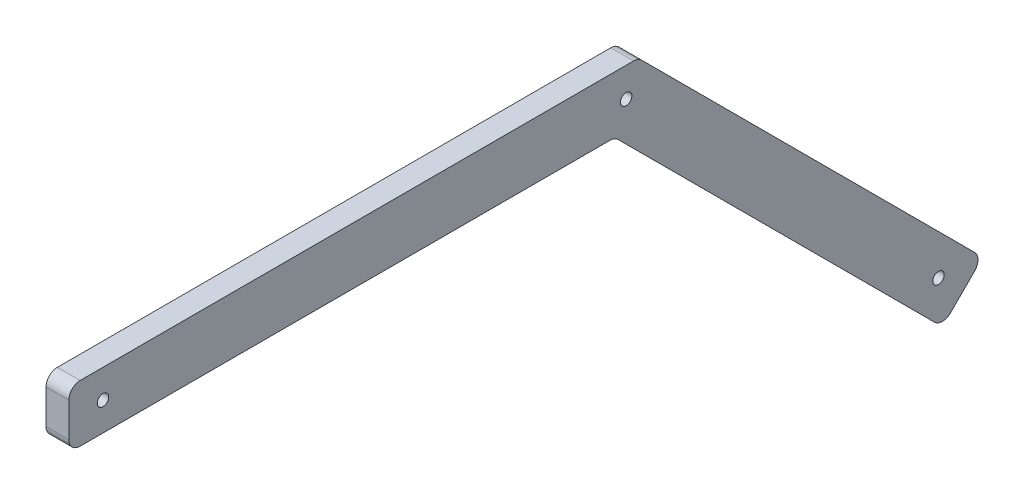
ISO-10303-21;
HEADER;
FILE_DESCRIPTION(('STEP AP214'),'2;1');
FILE_NAME('part.step','',(''),(''),'','','');
FILE_SCHEMA(('AUTOMOTIVE_DESIGN { 1 0 10303 214 1 1 1 1 }'));
ENDSEC;
DATA;
#1=APPLICATION_CONTEXT('core data for automotive mechanical design processes');
#2=APPLICATION_PROTOCOL_DEFINITION('international standard','automotive_design',2000,#1);
#3=PRODUCT_CONTEXT('',#1,'mechanical');
#4=PRODUCT('Part','Part','',(#3));
#5=PRODUCT_RELATED_PRODUCT_CATEGORY('part','',(#4));
#6=PRODUCT_DEFINITION_FORMATION('','',#4);
#7=PRODUCT_DEFINITION_CONTEXT('part definition',#1,'design');
#8=PRODUCT_DEFINITION('design','',#6,#7);
#9=PRODUCT_DEFINITION_SHAPE('','',#8);
#10=(LENGTH_UNIT() NAMED_UNIT(*) SI_UNIT(.MILLI.,.METRE.));
#11=(NAMED_UNIT(*) PLANE_ANGLE_UNIT() SI_UNIT($,.RADIAN.));
#12=(NAMED_UNIT(*) SI_UNIT($,.STERADIAN.) SOLID_ANGLE_UNIT());
#13=UNCERTAINTY_MEASURE_WITH_UNIT(LENGTH_MEASURE(1.E-05),#10,'distance_accuracy_value','');
#14=(GEOMETRIC_REPRESENTATION_CONTEXT(3) GLOBAL_UNCERTAINTY_ASSIGNED_CONTEXT((#13)) GLOBAL_UNIT_ASSIGNED_CONTEXT((#10,
#11,#12)) REPRESENTATION_CONTEXT('',''));
#15=CARTESIAN_POINT('',(0.,0.,0.));
#16=DIRECTION('',(0.,0.,1.));
#17=DIRECTION('',(1.,0.,0.));
#18=AXIS2_PLACEMENT_3D('',#15,#16,#17);
#19=CARTESIAN_POINT('',(20.,0.,0.));
#20=DIRECTION('',(0.,1.,0.));
#21=DIRECTION('',(0.,0.,1.));
#22=AXIS2_PLACEMENT_3D('',#19,#20,#21);
#23=PLANE('',#22);
#24=DIRECTION('',(0.,0.,-1.));
#25=VECTOR('',#24,1.);
#26=CARTESIAN_POINT('',(0.,0.,0.));
#27=LINE('',#26,#25);
#28=CARTESIAN_POINT('',(0.,0.,-10.));
#29=VERTEX_POINT('',#28);
#30=CARTESIAN_POINT('',(0.,0.,-475.147186257614));
#31=VERTEX_POINT('',#30);
#32=EDGE_CURVE('E159',#29,#31,#27,.T.);
#33=ORIENTED_EDGE('',*,*,#32,.T.);
#34=DIRECTION('',(-1.,0.,0.));
#35=VECTOR('',#34,1.);
#36=CARTESIAN_POINT('',(20.,0.,-475.147186257614));
#37=LINE('',#36,#35);
#38=CARTESIAN_POINT('',(20.,0.,-475.147186257614));
#39=VERTEX_POINT('',#38);
#40=EDGE_CURVE('E135',#31,#39,#37,.F.);
#41=ORIENTED_EDGE('',*,*,#40,.T.);
#42=DIRECTION('',(0.,0.,-1.));
#43=VECTOR('',#42,1.);
#44=CARTESIAN_POINT('',(20.,0.,0.));
#45=LINE('',#44,#43);
#46=CARTESIAN_POINT('',(20.,0.,-10.));
#47=VERTEX_POINT('',#46);
#48=EDGE_CURVE('E179',#47,#39,#45,.T.);
#49=ORIENTED_EDGE('',*,*,#48,.F.);
#50=DIRECTION('',(-1.,0.,0.));
#51=VECTOR('',#50,1.);
#52=CARTESIAN_POINT('',(0.,0.,-10.));
#53=LINE('',#52,#51);
#54=EDGE_CURVE('E150',#47,#29,#53,.T.);
#55=ORIENTED_EDGE('',*,*,#54,.T.);
#56=EDGE_LOOP('',(#33,#41,#49,#55));
#57=FACE_BOUND('',#56,.T.);
#58=ADVANCED_FACE('F40',(#57),#23,.F.);
#59=CARTESIAN_POINT('',(20.,239.644660940673,-239.644660940673));
#60=DIRECTION('',(0.,0.707106781186546,-0.707106781186549));
#61=DIRECTION('',(0.,0.707106781186549,0.707106781186546));
#62=AXIS2_PLACEMENT_3D('',#59,#60,#61);
#63=PLANE('',#62);
#64=DIRECTION('',(0.,-0.707106781186549,-0.707106781186546));
#65=VECTOR('',#64,1.);
#66=CARTESIAN_POINT('',(20.,239.644660940673,-239.644660940673));
#67=LINE('',#66,#65);
#68=CARTESIAN_POINT('',(20.,-2.92893218813448,-482.218254069479));
#69=VERTEX_POINT('',#68);
#70=CARTESIAN_POINT('',(20.,-280.651944618272,-759.941266499616));
#71=VERTEX_POINT('',#70);
#72=EDGE_CURVE('E148',#69,#71,#67,.T.);
#73=ORIENTED_EDGE('',*,*,#72,.F.);
#74=DIRECTION('',(-1.,0.,0.));
#75=VECTOR('',#74,1.);
#76=CARTESIAN_POINT('',(0.,-2.92893218813445,-482.218254069479));
#77=LINE('',#76,#75);
#78=CARTESIAN_POINT('',(0.,-2.92893218813448,-482.218254069479));
#79=VERTEX_POINT('',#78);
#80=EDGE_CURVE('E134',#69,#79,#77,.T.);
#81=ORIENTED_EDGE('',*,*,#80,.T.);
#82=DIRECTION('',(0.,-0.707106781186549,-0.707106781186546));
#83=VECTOR('',#82,1.);
#84=CARTESIAN_POINT('',(0.,239.644660940673,-239.644660940673));
#85=LINE('',#84,#83);
#86=CARTESIAN_POINT('',(0.,-280.651944618272,-759.941266499616));
#87=VERTEX_POINT('',#86);
#88=EDGE_CURVE('E145',#79,#87,#85,.T.);
#89=ORIENTED_EDGE('',*,*,#88,.T.);
#90=DIRECTION('',(-1.,0.,0.));
#91=VECTOR('',#90,1.);
#92=CARTESIAN_POINT('',(20.,-280.651944618272,-759.941266499616));
#93=LINE('',#92,#91);
#94=EDGE_CURVE('E151',#87,#71,#93,.F.);
#95=ORIENTED_EDGE('',*,*,#94,.T.);
#96=EDGE_LOOP('',(#73,#81,#89,#95));
#97=FACE_BOUND('',#96,.T.);
#98=ADVANCED_FACE('F144',(#97),#63,.F.);
#99=CARTESIAN_POINT('',(20.,-527.367673370811,-527.367673370805));
#100=DIRECTION('',(0.,-0.707106781186551,-0.707106781186544));
#101=DIRECTION('',(0.,0.707106781186544,-0.707106781186551));
#102=AXIS2_PLACEMENT_3D('',#99,#100,#101);
#103=PLANE('',#102);
#104=DIRECTION('',(0.,-0.707106781186544,0.707106781186551));
#105=VECTOR('',#104,1.);
#106=CARTESIAN_POINT('',(20.,-527.367673370811,-527.367673370805));
#107=LINE('',#106,#105);
#108=CARTESIAN_POINT('',(20.,-259.438741182676,-795.296605558944));
#109=VERTEX_POINT('',#108);
#110=CARTESIAN_POINT('',(20.,-280.651944618272,-774.083402123347));
#111=VERTEX_POINT('',#110);
#112=EDGE_CURVE('E251',#109,#111,#107,.T.);
#113=ORIENTED_EDGE('',*,*,#112,.T.);
#114=DIRECTION('',(-1.,0.,0.));
#115=VECTOR('',#114,1.);
#116=CARTESIAN_POINT('',(0.,-280.651944618272,-774.083402123347));
#117=LINE('',#116,#115);
#118=CARTESIAN_POINT('',(0.,-280.651944618272,-774.083402123347));
#119=VERTEX_POINT('',#118);
#120=EDGE_CURVE('E233',#111,#119,#117,.T.);
#121=ORIENTED_EDGE('',*,*,#120,.T.);
#122=DIRECTION('',(0.,-0.707106781186544,0.707106781186551));
#123=VECTOR('',#122,1.);
#124=CARTESIAN_POINT('',(0.,-527.367673370811,-527.367673370805));
#125=LINE('',#124,#123);
#126=CARTESIAN_POINT('',(0.,-259.438741182676,-795.296605558944));
#127=VERTEX_POINT('',#126);
#128=EDGE_CURVE('E158',#127,#119,#125,.T.);
#129=ORIENTED_EDGE('',*,*,#128,.F.);
#130=DIRECTION('',(-1.,0.,0.));
#131=VECTOR('',#130,1.);
#132=CARTESIAN_POINT('',(20.,-259.438741182676,-795.296605558944));
#133=LINE('',#132,#131);
#134=EDGE_CURVE('E230',#127,#109,#133,.F.);
#135=ORIENTED_EDGE('',*,*,#134,.T.);
#136=EDGE_LOOP('',(#113,#121,#129,#135));
#137=FACE_BOUND('',#136,.T.);
#138=ADVANCED_FACE('F330',(#137),#103,.T.);
#139=CARTESIAN_POINT('',(20.,275.,-275.000000000001));
#140=DIRECTION('',(0.,0.707106781186546,-0.707106781186549));
#141=DIRECTION('',(0.,0.707106781186549,0.707106781186546));
#142=AXIS2_PLACEMENT_3D('',#139,#140,#141);
#143=PLANE('',#142);
#144=DIRECTION('',(0.,-0.707106781186549,-0.707106781186546));
#145=VECTOR('',#144,1.);
#146=CARTESIAN_POINT('',(0.,275.,-275.000000000001));
#147=LINE('',#146,#145);
#148=CARTESIAN_POINT('',(0.,47.0710678118654,-502.928932188135));
#149=VERTEX_POINT('',#148);
#150=CARTESIAN_POINT('',(0.,-245.296605558945,-795.296605558944));
#151=VERTEX_POINT('',#150);
#152=EDGE_CURVE('E163',#149,#151,#147,.T.);
#153=ORIENTED_EDGE('',*,*,#152,.F.);
#154=DIRECTION('',(-1.,0.,0.));
#155=VECTOR('',#154,1.);
#156=CARTESIAN_POINT('',(20.,47.0710678118655,-502.928932188135));
#157=LINE('',#156,#155);
#158=CARTESIAN_POINT('',(20.,47.0710678118654,-502.928932188135));
#159=VERTEX_POINT('',#158);
#160=EDGE_CURVE('E213',#149,#159,#157,.F.);
#161=ORIENTED_EDGE('',*,*,#160,.T.);
#162=DIRECTION('',(0.,-0.707106781186549,-0.707106781186546));
#163=VECTOR('',#162,1.);
#164=CARTESIAN_POINT('',(20.,275.,-275.000000000001));
#165=LINE('',#164,#163);
#166=CARTESIAN_POINT('',(20.,-245.296605558945,-795.296605558944));
#167=VERTEX_POINT('',#166);
#168=EDGE_CURVE('E247',#159,#167,#165,.T.);
#169=ORIENTED_EDGE('',*,*,#168,.T.);
#170=DIRECTION('',(-1.,0.,0.));
#171=VECTOR('',#170,1.);
#172=CARTESIAN_POINT('',(20.,-245.296605558945,-795.296605558944));
#173=LINE('',#172,#171);
#174=EDGE_CURVE('E209',#167,#151,#173,.T.);
#175=ORIENTED_EDGE('',*,*,#174,.T.);
#176=EDGE_LOOP('',(#153,#161,#169,#175));
#177=FACE_BOUND('',#176,.T.);
#178=ADVANCED_FACE('F369',(#177),#143,.T.);
#179=CARTESIAN_POINT('',(20.,50.,0.));
#180=DIRECTION('',(0.,1.,0.));
#181=DIRECTION('',(0.,0.,1.));
#182=AXIS2_PLACEMENT_3D('',#179,#180,#181);
#183=PLANE('',#182);
#184=DIRECTION('',(0.,0.,-1.));
#185=VECTOR('',#184,1.);
#186=CARTESIAN_POINT('',(20.,50.,0.));
#187=LINE('',#186,#185);
#188=CARTESIAN_POINT('',(20.,50.,-10.));
#189=VERTEX_POINT('',#188);
#190=CARTESIAN_POINT('',(20.,50.,-495.857864376269));
#191=VERTEX_POINT('',#190);
#192=EDGE_CURVE('E244',#189,#191,#187,.T.);
#193=ORIENTED_EDGE('',*,*,#192,.T.);
#194=DIRECTION('',(-1.,0.,0.));
#195=VECTOR('',#194,1.);
#196=CARTESIAN_POINT('',(20.,50.,-495.857864376269));
#197=LINE('',#196,#195);
#198=CARTESIAN_POINT('',(0.,50.,-495.857864376269));
#199=VERTEX_POINT('',#198);
#200=EDGE_CURVE('E191',#191,#199,#197,.T.);
#201=ORIENTED_EDGE('',*,*,#200,.T.);
#202=DIRECTION('',(0.,0.,-1.));
#203=VECTOR('',#202,1.);
#204=CARTESIAN_POINT('',(0.,50.,0.));
#205=LINE('',#204,#203);
#206=CARTESIAN_POINT('',(0.,50.,-10.));
#207=VERTEX_POINT('',#206);
#208=EDGE_CURVE('E172',#207,#199,#205,.T.);
#209=ORIENTED_EDGE('',*,*,#208,.F.);
#210=DIRECTION('',(-1.,0.,0.));
#211=VECTOR('',#210,1.);
#212=CARTESIAN_POINT('',(20.,50.,-10.));
#213=LINE('',#212,#211);
#214=EDGE_CURVE('E188',#207,#189,#213,.F.);
#215=ORIENTED_EDGE('',*,*,#214,.T.);
#216=EDGE_LOOP('',(#193,#201,#209,#215));
#217=FACE_BOUND('',#216,.T.);
#218=ADVANCED_FACE('F315',(#217),#183,.T.);
#219=CARTESIAN_POINT('',(20.,0.,0.));
#220=DIRECTION('',(0.,0.,1.));
#221=DIRECTION('',(1.,0.,0.));
#222=AXIS2_PLACEMENT_3D('',#219,#220,#221);
#223=PLANE('',#222);
#224=DIRECTION('',(0.,1.,0.));
#225=VECTOR('',#224,1.);
#226=CARTESIAN_POINT('',(0.,0.,0.));
#227=LINE('',#226,#225);
#228=CARTESIAN_POINT('',(0.,10.,0.));
#229=VERTEX_POINT('',#228);
#230=CARTESIAN_POINT('',(0.,40.,0.));
#231=VERTEX_POINT('',#230);
#232=EDGE_CURVE('E175',#229,#231,#227,.T.);
#233=ORIENTED_EDGE('',*,*,#232,.F.);
#234=DIRECTION('',(-1.,0.,0.));
#235=VECTOR('',#234,1.);
#236=CARTESIAN_POINT('',(20.,10.,0.));
#237=LINE('',#236,#235);
#238=CARTESIAN_POINT('',(20.,10.,0.));
#239=VERTEX_POINT('',#238);
#240=EDGE_CURVE('E63',#229,#239,#237,.F.);
#241=ORIENTED_EDGE('',*,*,#240,.T.);
#242=DIRECTION('',(0.,1.,0.));
#243=VECTOR('',#242,1.);
#244=CARTESIAN_POINT('',(20.,0.,0.));
#245=LINE('',#244,#243);
#246=CARTESIAN_POINT('',(20.,40.,0.));
#247=VERTEX_POINT('',#246);
#248=EDGE_CURVE('E181',#239,#247,#245,.T.);
#249=ORIENTED_EDGE('',*,*,#248,.T.);
#250=DIRECTION('',(-1.,0.,0.));
#251=VECTOR('',#250,1.);
#252=CARTESIAN_POINT('',(20.,40.,0.));
#253=LINE('',#252,#251);
#254=EDGE_CURVE('E237',#247,#231,#253,.T.);
#255=ORIENTED_EDGE('',*,*,#254,.T.);
#256=EDGE_LOOP('',(#233,#241,#249,#255));
#257=FACE_BOUND('',#256,.T.);
#258=ADVANCED_FACE('F298',(#257),#223,.T.);
#259=CARTESIAN_POINT('',(20.,0.,0.));
#260=DIRECTION('',(1.,0.,0.));
#261=DIRECTION('',(0.,0.,-1.));
#262=AXIS2_PLACEMENT_3D('',#259,#260,#261);
#263=PLANE('',#262);
#264=CARTESIAN_POINT('',(20.,24.2387953251129,-489.329359640592));
#265=DIRECTION('',(1.,0.,0.));
#266=DIRECTION('',(0.,0.,-1.));
#267=AXIS2_PLACEMENT_3D('',#264,#265,#266);
#268=CIRCLE('',#267,4.99999999999999);
#269=CARTESIAN_POINT('',(20.,24.2387953251129,-494.329359640592));
#270=VERTEX_POINT('',#269);
#271=EDGE_CURVE('E278',#270,#270,#268,.T.);
#272=ORIENTED_EDGE('',*,*,#271,.F.);
#273=EDGE_LOOP('',(#272));
#274=FACE_BOUND('',#273,.T.);
#275=CARTESIAN_POINT('',(20.,-248.832139464877,-763.476800405549));
#276=DIRECTION('',(1.,0.,0.));
#277=DIRECTION('',(0.,0.,-1.));
#278=AXIS2_PLACEMENT_3D('',#275,#276,#277);
#279=CIRCLE('',#278,5.00000000000005);
#280=CARTESIAN_POINT('',(20.,-248.832139464877,-768.476800405549));
#281=VERTEX_POINT('',#280);
#282=EDGE_CURVE('E270',#281,#281,#279,.T.);
#283=ORIENTED_EDGE('',*,*,#282,.F.);
#284=EDGE_LOOP('',(#283));
#285=FACE_BOUND('',#284,.T.);
#286=CARTESIAN_POINT('',(20.,25.,-30.));
#287=DIRECTION('',(1.,0.,0.));
#288=DIRECTION('',(0.,0.,-1.));
#289=AXIS2_PLACEMENT_3D('',#286,#287,#288);
#290=CIRCLE('',#289,5.);
#291=CARTESIAN_POINT('',(20.,25.,-35.));
#292=VERTEX_POINT('',#291);
#293=EDGE_CURVE('E262',#292,#292,#290,.T.);
#294=ORIENTED_EDGE('',*,*,#293,.F.);
#295=EDGE_LOOP('',(#294));
#296=FACE_BOUND('',#295,.T.);
#297=ORIENTED_EDGE('',*,*,#168,.F.);
#298=CARTESIAN_POINT('',(20.,40.,-495.857864376269));
#299=DIRECTION('',(1.,0.,0.));
#300=DIRECTION('',(0.,0.,-1.));
#301=AXIS2_PLACEMENT_3D('',#298,#299,#300);
#302=CIRCLE('',#301,10.);
#303=EDGE_CURVE('E227',#159,#191,#302,.T.);
#304=ORIENTED_EDGE('',*,*,#303,.T.);
#305=ORIENTED_EDGE('',*,*,#192,.F.);
#306=CARTESIAN_POINT('',(20.,40.,-10.));
#307=DIRECTION('',(1.,0.,0.));
#308=DIRECTION('',(0.,0.,-1.));
#309=AXIS2_PLACEMENT_3D('',#306,#307,#308);
#310=CIRCLE('',#309,10.);
#311=EDGE_CURVE('E56',#189,#247,#310,.T.);
#312=ORIENTED_EDGE('',*,*,#311,.T.);
#313=ORIENTED_EDGE('',*,*,#248,.F.);
#314=CARTESIAN_POINT('',(20.,10.,-10.));
#315=DIRECTION('',(1.,0.,0.));
#316=DIRECTION('',(0.,0.,-1.));
#317=AXIS2_PLACEMENT_3D('',#314,#315,#316);
#318=CIRCLE('',#317,10.);
#319=EDGE_CURVE('E218',#239,#47,#318,.T.);
#320=ORIENTED_EDGE('',*,*,#319,.T.);
#321=ORIENTED_EDGE('',*,*,#48,.T.);
#322=CARTESIAN_POINT('',(20.,-9.99999999999993,-475.147186257614));
#323=DIRECTION('',(1.,0.,0.));
#324=DIRECTION('',(0.,0.,-1.));
#325=AXIS2_PLACEMENT_3D('',#322,#323,#324);
#326=CIRCLE('',#325,10.);
#327=EDGE_CURVE('E11',#39,#69,#326,.F.);
#328=ORIENTED_EDGE('',*,*,#327,.T.);
#329=ORIENTED_EDGE('',*,*,#72,.T.);
#330=CARTESIAN_POINT('',(20.,-273.580876806406,-767.012334311482));
#331=DIRECTION('',(1.,0.,0.));
#332=DIRECTION('',(0.,0.,-1.));
#333=AXIS2_PLACEMENT_3D('',#330,#331,#332);
#334=CIRCLE('',#333,10.);
#335=EDGE_CURVE('E224',#71,#111,#334,.T.);
#336=ORIENTED_EDGE('',*,*,#335,.T.);
#337=ORIENTED_EDGE('',*,*,#112,.F.);
#338=CARTESIAN_POINT('',(20.,-252.36767337081,-788.225537747078));
#339=DIRECTION('',(1.,0.,0.));
#340=DIRECTION('',(0.,0.,-1.));
#341=AXIS2_PLACEMENT_3D('',#338,#339,#340);
#342=CIRCLE('',#341,10.);
#343=EDGE_CURVE('E221',#109,#167,#342,.T.);
#344=ORIENTED_EDGE('',*,*,#343,.T.);
#345=EDGE_LOOP('',(#297,#304,#305,#312,#313,#320,#321,#328,#329,#336,#337,#344));
#346=FACE_BOUND('',#345,.T.);
#347=ADVANCED_FACE('F295',(#274,#285,#296,#346),#263,.T.);
#348=CARTESIAN_POINT('',(0.,0.,0.));
#349=DIRECTION('',(1.,0.,0.));
#350=DIRECTION('',(0.,0.,-1.));
#351=AXIS2_PLACEMENT_3D('',#348,#349,#350);
#352=PLANE('',#351);
#353=CARTESIAN_POINT('',(0.,24.2387953251129,-489.329359640592));
#354=DIRECTION('',(1.,0.,0.));
#355=DIRECTION('',(0.,0.,-1.));
#356=AXIS2_PLACEMENT_3D('',#353,#354,#355);
#357=CIRCLE('',#356,4.99999999999999);
#358=CARTESIAN_POINT('',(0.,24.2387953251129,-494.329359640592));
#359=VERTEX_POINT('',#358);
#360=EDGE_CURVE('E274',#359,#359,#357,.T.);
#361=ORIENTED_EDGE('',*,*,#360,.T.);
#362=EDGE_LOOP('',(#361));
#363=FACE_BOUND('',#362,.T.);
#364=CARTESIAN_POINT('',(0.,-248.832139464877,-763.476800405549));
#365=DIRECTION('',(1.,0.,0.));
#366=DIRECTION('',(0.,0.,-1.));
#367=AXIS2_PLACEMENT_3D('',#364,#365,#366);
#368=CIRCLE('',#367,5.00000000000005);
#369=CARTESIAN_POINT('',(0.,-248.832139464877,-768.476800405549));
#370=VERTEX_POINT('',#369);
#371=EDGE_CURVE('E266',#370,#370,#368,.T.);
#372=ORIENTED_EDGE('',*,*,#371,.T.);
#373=EDGE_LOOP('',(#372));
#374=FACE_BOUND('',#373,.T.);
#375=CARTESIAN_POINT('',(0.,25.,-30.));
#376=DIRECTION('',(1.,0.,0.));
#377=DIRECTION('',(0.,0.,-1.));
#378=AXIS2_PLACEMENT_3D('',#375,#376,#377);
#379=CIRCLE('',#378,5.);
#380=CARTESIAN_POINT('',(0.,25.,-35.));
#381=VERTEX_POINT('',#380);
#382=EDGE_CURVE('E165',#381,#381,#379,.T.);
#383=ORIENTED_EDGE('',*,*,#382,.T.);
#384=EDGE_LOOP('',(#383));
#385=FACE_BOUND('',#384,.T.);
#386=ORIENTED_EDGE('',*,*,#208,.T.);
#387=CARTESIAN_POINT('',(0.,40.,-495.857864376269));
#388=DIRECTION('',(1.,0.,0.));
#389=DIRECTION('',(0.,0.,-1.));
#390=AXIS2_PLACEMENT_3D('',#387,#388,#389);
#391=CIRCLE('',#390,10.);
#392=EDGE_CURVE('E206',#199,#149,#391,.F.);
#393=ORIENTED_EDGE('',*,*,#392,.T.);
#394=ORIENTED_EDGE('',*,*,#152,.T.);
#395=CARTESIAN_POINT('',(0.,-252.36767337081,-788.225537747078));
#396=DIRECTION('',(1.,0.,0.));
#397=DIRECTION('',(0.,0.,-1.));
#398=AXIS2_PLACEMENT_3D('',#395,#396,#397);
#399=CIRCLE('',#398,10.);
#400=EDGE_CURVE('E201',#151,#127,#399,.F.);
#401=ORIENTED_EDGE('',*,*,#400,.T.);
#402=ORIENTED_EDGE('',*,*,#128,.T.);
#403=CARTESIAN_POINT('',(0.,-273.580876806406,-767.012334311482));
#404=DIRECTION('',(1.,0.,0.));
#405=DIRECTION('',(0.,0.,-1.));
#406=AXIS2_PLACEMENT_3D('',#403,#404,#405);
#407=CIRCLE('',#406,10.);
#408=EDGE_CURVE('E156',#119,#87,#407,.F.);
#409=ORIENTED_EDGE('',*,*,#408,.T.);
#410=ORIENTED_EDGE('',*,*,#88,.F.);
#411=CARTESIAN_POINT('',(0.,-9.99999999999993,-475.147186257614));
#412=DIRECTION('',(1.,0.,0.));
#413=DIRECTION('',(0.,0.,-1.));
#414=AXIS2_PLACEMENT_3D('',#411,#412,#413);
#415=CIRCLE('',#414,10.);
#416=EDGE_CURVE('E49',#79,#31,#415,.T.);
#417=ORIENTED_EDGE('',*,*,#416,.T.);
#418=ORIENTED_EDGE('',*,*,#32,.F.);
#419=CARTESIAN_POINT('',(0.,10.,-10.));
#420=DIRECTION('',(1.,0.,0.));
#421=DIRECTION('',(0.,0.,-1.));
#422=AXIS2_PLACEMENT_3D('',#419,#420,#421);
#423=CIRCLE('',#422,10.);
#424=EDGE_CURVE('E198',#29,#229,#423,.F.);
#425=ORIENTED_EDGE('',*,*,#424,.T.);
#426=ORIENTED_EDGE('',*,*,#232,.T.);
#427=CARTESIAN_POINT('',(0.,40.,-10.));
#428=DIRECTION('',(1.,0.,0.));
#429=DIRECTION('',(0.,0.,-1.));
#430=AXIS2_PLACEMENT_3D('',#427,#428,#429);
#431=CIRCLE('',#430,10.);
#432=EDGE_CURVE('E195',#231,#207,#431,.F.);
#433=ORIENTED_EDGE('',*,*,#432,.T.);
#434=EDGE_LOOP('',(#386,#393,#394,#401,#402,#409,#410,#417,#418,#425,#426,#433));
#435=FACE_BOUND('',#434,.T.);
#436=ADVANCED_FACE('F154',(#363,#374,#385,#435),#352,.F.);
#437=CARTESIAN_POINT('',(20.,-9.99999999999993,-475.147186257614));
#438=DIRECTION('',(1.,0.,0.));
#439=DIRECTION('',(0.,0.,-1.));
#440=AXIS2_PLACEMENT_3D('',#437,#438,#439);
#441=CYLINDRICAL_SURFACE('',#440,10.);
#442=ORIENTED_EDGE('',*,*,#327,.F.);
#443=ORIENTED_EDGE('',*,*,#40,.F.);
#444=ORIENTED_EDGE('',*,*,#416,.F.);
#445=ORIENTED_EDGE('',*,*,#80,.F.);
#446=EDGE_LOOP('',(#442,#443,#444,#445));
#447=FACE_BOUND('',#446,.T.);
#448=ADVANCED_FACE('F133',(#447),#441,.F.);
#449=CARTESIAN_POINT('',(20.,40.,-495.857864376269));
#450=DIRECTION('',(-1.,0.,0.));
#451=DIRECTION('',(0.,0.,1.));
#452=AXIS2_PLACEMENT_3D('',#449,#450,#451);
#453=CYLINDRICAL_SURFACE('',#452,10.);
#454=ORIENTED_EDGE('',*,*,#303,.F.);
#455=ORIENTED_EDGE('',*,*,#160,.F.);
#456=ORIENTED_EDGE('',*,*,#392,.F.);
#457=ORIENTED_EDGE('',*,*,#200,.F.);
#458=EDGE_LOOP('',(#454,#455,#456,#457));
#459=FACE_BOUND('',#458,.T.);
#460=ADVANCED_FACE('F312',(#459),#453,.T.);
#461=CARTESIAN_POINT('',(20.,-273.580876806406,-767.012334311482));
#462=DIRECTION('',(1.,0.,0.));
#463=DIRECTION('',(0.,0.,-1.));
#464=AXIS2_PLACEMENT_3D('',#461,#462,#463);
#465=CYLINDRICAL_SURFACE('',#464,10.);
#466=ORIENTED_EDGE('',*,*,#335,.F.);
#467=ORIENTED_EDGE('',*,*,#94,.F.);
#468=ORIENTED_EDGE('',*,*,#408,.F.);
#469=ORIENTED_EDGE('',*,*,#120,.F.);
#470=EDGE_LOOP('',(#466,#467,#468,#469));
#471=FACE_BOUND('',#470,.T.);
#472=ADVANCED_FACE('F338',(#471),#465,.T.);
#473=CARTESIAN_POINT('',(20.,-252.36767337081,-788.225537747078));
#474=DIRECTION('',(-1.,0.,0.));
#475=DIRECTION('',(0.,0.,1.));
#476=AXIS2_PLACEMENT_3D('',#473,#474,#475);
#477=CYLINDRICAL_SURFACE('',#476,10.);
#478=ORIENTED_EDGE('',*,*,#343,.F.);
#479=ORIENTED_EDGE('',*,*,#134,.F.);
#480=ORIENTED_EDGE('',*,*,#400,.F.);
#481=ORIENTED_EDGE('',*,*,#174,.F.);
#482=EDGE_LOOP('',(#478,#479,#480,#481));
#483=FACE_BOUND('',#482,.T.);
#484=ADVANCED_FACE('F341',(#483),#477,.T.);
#485=CARTESIAN_POINT('',(20.,10.,-10.));
#486=DIRECTION('',(1.,0.,0.));
#487=DIRECTION('',(0.,0.,-1.));
#488=AXIS2_PLACEMENT_3D('',#485,#486,#487);
#489=CYLINDRICAL_SURFACE('',#488,10.);
#490=ORIENTED_EDGE('',*,*,#319,.F.);
#491=ORIENTED_EDGE('',*,*,#240,.F.);
#492=ORIENTED_EDGE('',*,*,#424,.F.);
#493=ORIENTED_EDGE('',*,*,#54,.F.);
#494=EDGE_LOOP('',(#490,#491,#492,#493));
#495=FACE_BOUND('',#494,.T.);
#496=ADVANCED_FACE('F323',(#495),#489,.T.);
#497=CARTESIAN_POINT('',(20.,40.,-10.));
#498=DIRECTION('',(-1.,0.,0.));
#499=DIRECTION('',(0.,0.,1.));
#500=AXIS2_PLACEMENT_3D('',#497,#498,#499);
#501=CYLINDRICAL_SURFACE('',#500,10.);
#502=ORIENTED_EDGE('',*,*,#311,.F.);
#503=ORIENTED_EDGE('',*,*,#214,.F.);
#504=ORIENTED_EDGE('',*,*,#432,.F.);
#505=ORIENTED_EDGE('',*,*,#254,.F.);
#506=EDGE_LOOP('',(#502,#503,#504,#505));
#507=FACE_BOUND('',#506,.T.);
#508=ADVANCED_FACE('F42',(#507),#501,.T.);
#509=CARTESIAN_POINT('',(0.,25.,-30.));
#510=DIRECTION('',(1.,0.,0.));
#511=DIRECTION('',(0.,0.,-1.));
#512=AXIS2_PLACEMENT_3D('',#509,#510,#511);
#513=CYLINDRICAL_SURFACE('',#512,5.);
#514=ORIENTED_EDGE('',*,*,#382,.F.);
#515=EDGE_LOOP('',(#514));
#516=FACE_BOUND('',#515,.T.);
#517=ORIENTED_EDGE('',*,*,#293,.T.);
#518=EDGE_LOOP('',(#517));
#519=FACE_BOUND('',#518,.T.);
#520=ADVANCED_FACE('F349',(#516,#519),#513,.F.);
#521=CARTESIAN_POINT('',(0.,-248.832139464877,-763.476800405549));
#522=DIRECTION('',(1.,0.,0.));
#523=DIRECTION('',(0.,0.,-1.));
#524=AXIS2_PLACEMENT_3D('',#521,#522,#523);
#525=CYLINDRICAL_SURFACE('',#524,5.00000000000005);
#526=ORIENTED_EDGE('',*,*,#371,.F.);
#527=EDGE_LOOP('',(#526));
#528=FACE_BOUND('',#527,.T.);
#529=ORIENTED_EDGE('',*,*,#282,.T.);
#530=EDGE_LOOP('',(#529));
#531=FACE_BOUND('',#530,.T.);
#532=ADVANCED_FACE('F291',(#528,#531),#525,.F.);
#533=CARTESIAN_POINT('',(0.,24.2387953251129,-489.329359640592));
#534=DIRECTION('',(1.,0.,0.));
#535=DIRECTION('',(0.,0.,-1.));
#536=AXIS2_PLACEMENT_3D('',#533,#534,#535);
#537=CYLINDRICAL_SURFACE('',#536,4.99999999999999);
#538=ORIENTED_EDGE('',*,*,#360,.F.);
#539=EDGE_LOOP('',(#538));
#540=FACE_BOUND('',#539,.T.);
#541=ORIENTED_EDGE('',*,*,#271,.T.);
#542=EDGE_LOOP('',(#541));
#543=FACE_BOUND('',#542,.T.);
#544=ADVANCED_FACE('F288',(#540,#543),#537,.F.);
#545=CLOSED_SHELL('',(#58,#98,#138,#178,#218,#258,#347,#436,#448,#460,#472,#484,#496,#508,#520,
#532,#544));
#546=MANIFOLD_SOLID_BREP('B2',#545);
#547=ADVANCED_BREP_SHAPE_REPRESENTATION('',(#18,#546),#14);
#548=SHAPE_DEFINITION_REPRESENTATION(#9,#547);
ENDSEC;
END-ISO-10303-21;
